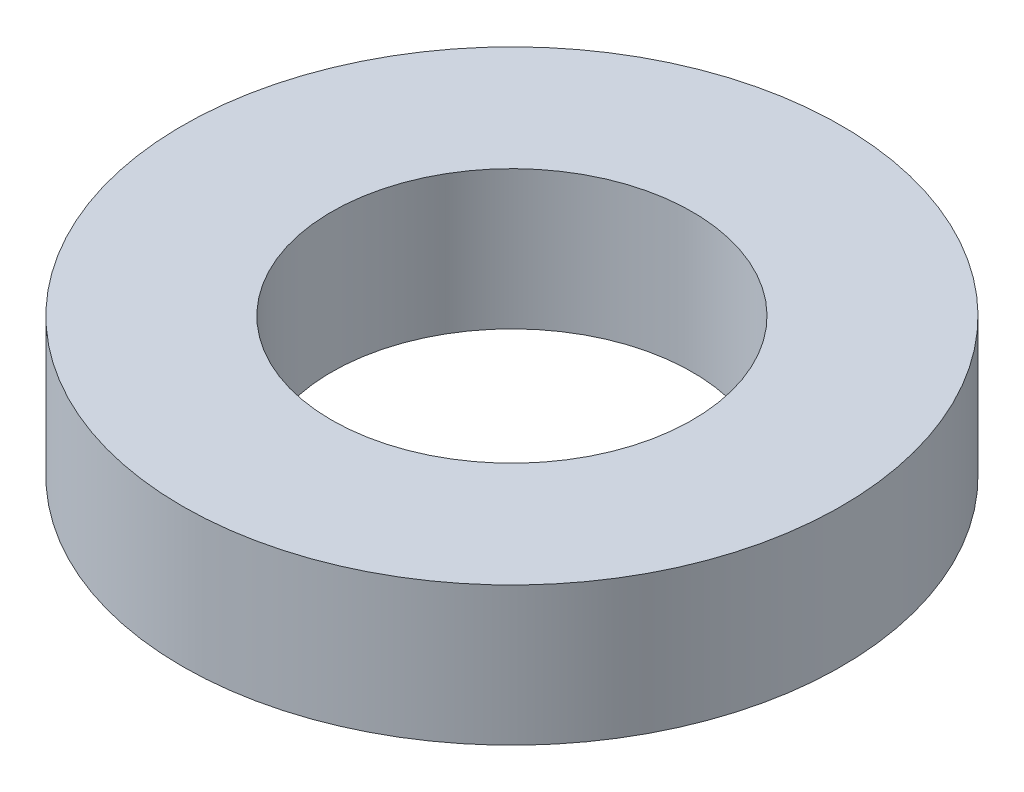
ISO-10303-21;
HEADER;
FILE_DESCRIPTION(('STEP AP214'),'2;1');
FILE_NAME('part.step','',(''),(''),'','','');
FILE_SCHEMA(('AUTOMOTIVE_DESIGN { 1 0 10303 214 1 1 1 1 }'));
ENDSEC;
DATA;
#1=APPLICATION_CONTEXT('core data for automotive mechanical design processes');
#2=APPLICATION_PROTOCOL_DEFINITION('international standard','automotive_design',2000,#1);
#3=PRODUCT_CONTEXT('',#1,'mechanical');
#4=PRODUCT('Part','Part','',(#3));
#5=PRODUCT_RELATED_PRODUCT_CATEGORY('part','',(#4));
#6=PRODUCT_DEFINITION_FORMATION('','',#4);
#7=PRODUCT_DEFINITION_CONTEXT('part definition',#1,'design');
#8=PRODUCT_DEFINITION('design','',#6,#7);
#9=PRODUCT_DEFINITION_SHAPE('','',#8);
#10=(LENGTH_UNIT() NAMED_UNIT(*) SI_UNIT(.MILLI.,.METRE.));
#11=(NAMED_UNIT(*) PLANE_ANGLE_UNIT() SI_UNIT($,.RADIAN.));
#12=(NAMED_UNIT(*) SI_UNIT($,.STERADIAN.) SOLID_ANGLE_UNIT());
#13=UNCERTAINTY_MEASURE_WITH_UNIT(LENGTH_MEASURE(1.E-05),#10,'distance_accuracy_value','');
#14=(GEOMETRIC_REPRESENTATION_CONTEXT(3) GLOBAL_UNCERTAINTY_ASSIGNED_CONTEXT((#13)) GLOBAL_UNIT_ASSIGNED_CONTEXT((#10,
#11,#12)) REPRESENTATION_CONTEXT('',''));
#15=CARTESIAN_POINT('',(0.,0.,0.));
#16=DIRECTION('',(0.,0.,1.));
#17=DIRECTION('',(1.,0.,0.));
#18=AXIS2_PLACEMENT_3D('',#15,#16,#17);
#19=CARTESIAN_POINT('',(0.,2.,0.));
#20=DIRECTION('',(0.,1.,0.));
#21=DIRECTION('',(0.,0.,1.));
#22=AXIS2_PLACEMENT_3D('',#19,#20,#21);
#23=PLANE('',#22);
#24=CARTESIAN_POINT('',(0.,2.,0.));
#25=DIRECTION('',(0.,1.,0.));
#26=DIRECTION('',(0.,0.,1.));
#27=AXIS2_PLACEMENT_3D('',#24,#25,#26);
#28=CIRCLE('',#27,4.75);
#29=CARTESIAN_POINT('',(0.,2.,4.75));
#30=VERTEX_POINT('',#29);
#31=EDGE_CURVE('E10',#30,#30,#28,.T.);
#32=ORIENTED_EDGE('',*,*,#31,.T.);
#33=EDGE_LOOP('',(#32));
#34=FACE_BOUND('',#33,.T.);
#35=CARTESIAN_POINT('',(0.,2.,0.));
#36=DIRECTION('',(0.,1.,0.));
#37=DIRECTION('',(0.,0.,1.));
#38=AXIS2_PLACEMENT_3D('',#35,#36,#37);
#39=CIRCLE('',#38,2.6);
#40=CARTESIAN_POINT('',(0.,2.,2.6));
#41=VERTEX_POINT('',#40);
#42=EDGE_CURVE('E42',#41,#41,#39,.T.);
#43=ORIENTED_EDGE('',*,*,#42,.F.);
#44=EDGE_LOOP('',(#43));
#45=FACE_BOUND('',#44,.T.);
#46=ADVANCED_FACE('F31',(#34,#45),#23,.T.);
#47=CARTESIAN_POINT('',(0.,0.,0.));
#48=DIRECTION('',(0.,1.,0.));
#49=DIRECTION('',(0.,0.,1.));
#50=AXIS2_PLACEMENT_3D('',#47,#48,#49);
#51=PLANE('',#50);
#52=CARTESIAN_POINT('',(0.,0.,0.));
#53=DIRECTION('',(0.,1.,0.));
#54=DIRECTION('',(0.,0.,1.));
#55=AXIS2_PLACEMENT_3D('',#52,#53,#54);
#56=CIRCLE('',#55,4.75);
#57=CARTESIAN_POINT('',(0.,0.,4.75));
#58=VERTEX_POINT('',#57);
#59=EDGE_CURVE('E35',#58,#58,#56,.T.);
#60=ORIENTED_EDGE('',*,*,#59,.F.);
#61=EDGE_LOOP('',(#60));
#62=FACE_BOUND('',#61,.T.);
#63=CARTESIAN_POINT('',(0.,0.,0.));
#64=DIRECTION('',(0.,1.,0.));
#65=DIRECTION('',(0.,0.,1.));
#66=AXIS2_PLACEMENT_3D('',#63,#64,#65);
#67=CIRCLE('',#66,2.6);
#68=CARTESIAN_POINT('',(0.,0.,2.6));
#69=VERTEX_POINT('',#68);
#70=EDGE_CURVE('E44',#69,#69,#67,.T.);
#71=ORIENTED_EDGE('',*,*,#70,.T.);
#72=EDGE_LOOP('',(#71));
#73=FACE_BOUND('',#72,.T.);
#74=ADVANCED_FACE('F54',(#62,#73),#51,.F.);
#75=CARTESIAN_POINT('',(0.,2.,0.));
#76=DIRECTION('',(0.,-1.,0.));
#77=DIRECTION('',(0.,0.,-1.));
#78=AXIS2_PLACEMENT_3D('',#75,#76,#77);
#79=CYLINDRICAL_SURFACE('',#78,4.75);
#80=ORIENTED_EDGE('',*,*,#31,.F.);
#81=EDGE_LOOP('',(#80));
#82=FACE_BOUND('',#81,.T.);
#83=ORIENTED_EDGE('',*,*,#59,.T.);
#84=EDGE_LOOP('',(#83));
#85=FACE_BOUND('',#84,.T.);
#86=ADVANCED_FACE('F33',(#82,#85),#79,.T.);
#87=CARTESIAN_POINT('',(0.,2.,0.));
#88=DIRECTION('',(0.,-1.,0.));
#89=DIRECTION('',(0.,0.,-1.));
#90=AXIS2_PLACEMENT_3D('',#87,#88,#89);
#91=CYLINDRICAL_SURFACE('',#90,2.6);
#92=ORIENTED_EDGE('',*,*,#42,.T.);
#93=EDGE_LOOP('',(#92));
#94=FACE_BOUND('',#93,.T.);
#95=ORIENTED_EDGE('',*,*,#70,.F.);
#96=EDGE_LOOP('',(#95));
#97=FACE_BOUND('',#96,.T.);
#98=ADVANCED_FACE('F50',(#94,#97),#91,.F.);
#99=CLOSED_SHELL('',(#46,#74,#86,#98));
#100=MANIFOLD_SOLID_BREP('B2',#99);
#101=ADVANCED_BREP_SHAPE_REPRESENTATION('',(#18,#100),#14);
#102=SHAPE_DEFINITION_REPRESENTATION(#9,#101);
ENDSEC;
END-ISO-10303-21;
